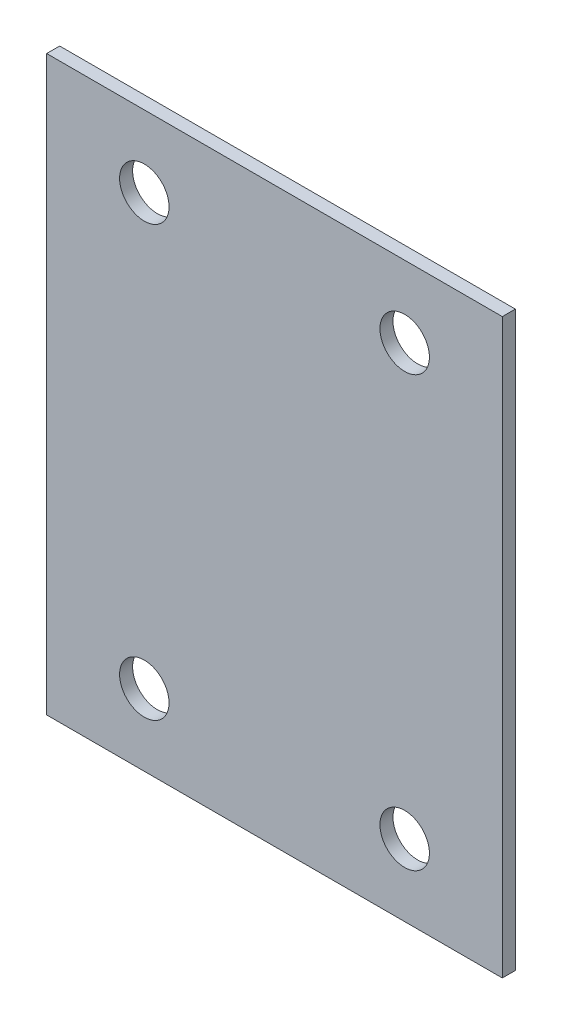
ISO-10303-21;
HEADER;
FILE_DESCRIPTION(('STEP AP214'),'2;1');
FILE_NAME('part.step','',(''),(''),'','','');
FILE_SCHEMA(('AUTOMOTIVE_DESIGN { 1 0 10303 214 1 1 1 1 }'));
ENDSEC;
DATA;
#1=APPLICATION_CONTEXT('core data for automotive mechanical design processes');
#2=APPLICATION_PROTOCOL_DEFINITION('international standard','automotive_design',2000,#1);
#3=PRODUCT_CONTEXT('',#1,'mechanical');
#4=PRODUCT('Part','Part','',(#3));
#5=PRODUCT_RELATED_PRODUCT_CATEGORY('part','',(#4));
#6=PRODUCT_DEFINITION_FORMATION('','',#4);
#7=PRODUCT_DEFINITION_CONTEXT('part definition',#1,'design');
#8=PRODUCT_DEFINITION('design','',#6,#7);
#9=PRODUCT_DEFINITION_SHAPE('','',#8);
#10=(LENGTH_UNIT() NAMED_UNIT(*) SI_UNIT(.MILLI.,.METRE.));
#11=(NAMED_UNIT(*) PLANE_ANGLE_UNIT() SI_UNIT($,.RADIAN.));
#12=(NAMED_UNIT(*) SI_UNIT($,.STERADIAN.) SOLID_ANGLE_UNIT());
#13=UNCERTAINTY_MEASURE_WITH_UNIT(LENGTH_MEASURE(1.E-05),#10,'distance_accuracy_value','');
#14=(GEOMETRIC_REPRESENTATION_CONTEXT(3) GLOBAL_UNCERTAINTY_ASSIGNED_CONTEXT((#13)) GLOBAL_UNIT_ASSIGNED_CONTEXT((#10,
#11,#12)) REPRESENTATION_CONTEXT('',''));
#15=CARTESIAN_POINT('',(0.,0.,0.));
#16=DIRECTION('',(0.,0.,1.));
#17=DIRECTION('',(1.,0.,0.));
#18=AXIS2_PLACEMENT_3D('',#15,#16,#17);
#19=CARTESIAN_POINT('',(0.,0.,10.));
#20=DIRECTION('',(0.,0.,1.));
#21=DIRECTION('',(1.,0.,0.));
#22=AXIS2_PLACEMENT_3D('',#19,#20,#21);
#23=PLANE('',#22);
#24=CARTESIAN_POINT('',(100.,-165.,10.));
#25=DIRECTION('',(0.,0.,1.));
#26=DIRECTION('',(1.,0.,0.));
#27=AXIS2_PLACEMENT_3D('',#24,#25,#26);
#28=CIRCLE('',#27,19.);
#29=CARTESIAN_POINT('',(119.,-165.,10.));
#30=VERTEX_POINT('',#29);
#31=EDGE_CURVE('E121',#30,#30,#28,.T.);
#32=ORIENTED_EDGE('',*,*,#31,.F.);
#33=EDGE_LOOP('',(#32));
#34=FACE_BOUND('',#33,.T.);
#35=CARTESIAN_POINT('',(-100.,165.,10.));
#36=DIRECTION('',(0.,0.,1.));
#37=DIRECTION('',(1.,0.,0.));
#38=AXIS2_PLACEMENT_3D('',#35,#36,#37);
#39=CIRCLE('',#38,19.0000000000034);
#40=CARTESIAN_POINT('',(-80.9999999999966,165.,10.));
#41=VERTEX_POINT('',#40);
#42=EDGE_CURVE('E100',#41,#41,#39,.T.);
#43=ORIENTED_EDGE('',*,*,#42,.F.);
#44=EDGE_LOOP('',(#43));
#45=FACE_BOUND('',#44,.T.);
#46=DIRECTION('',(1.,0.,0.));
#47=VECTOR('',#46,1.);
#48=CARTESIAN_POINT('',(-175.,-220.,10.));
#49=LINE('',#48,#47);
#50=CARTESIAN_POINT('',(-175.,-220.,10.));
#51=VERTEX_POINT('',#50);
#52=CARTESIAN_POINT('',(175.,-220.,10.));
#53=VERTEX_POINT('',#52);
#54=EDGE_CURVE('E85',#51,#53,#49,.T.);
#55=ORIENTED_EDGE('',*,*,#54,.T.);
#56=DIRECTION('',(0.,1.,0.));
#57=VECTOR('',#56,1.);
#58=CARTESIAN_POINT('',(175.,-220.,10.));
#59=LINE('',#58,#57);
#60=CARTESIAN_POINT('',(175.,220.,10.));
#61=VERTEX_POINT('',#60);
#62=EDGE_CURVE('E80',#53,#61,#59,.T.);
#63=ORIENTED_EDGE('',*,*,#62,.T.);
#64=DIRECTION('',(-1.,0.,0.));
#65=VECTOR('',#64,1.);
#66=CARTESIAN_POINT('',(175.,220.,10.));
#67=LINE('',#66,#65);
#68=CARTESIAN_POINT('',(-175.,220.,10.));
#69=VERTEX_POINT('',#68);
#70=EDGE_CURVE('E83',#61,#69,#67,.T.);
#71=ORIENTED_EDGE('',*,*,#70,.T.);
#72=DIRECTION('',(0.,-1.,0.));
#73=VECTOR('',#72,1.);
#74=CARTESIAN_POINT('',(-175.,220.,10.));
#75=LINE('',#74,#73);
#76=EDGE_CURVE('E50',#69,#51,#75,.T.);
#77=ORIENTED_EDGE('',*,*,#76,.T.);
#78=EDGE_LOOP('',(#55,#63,#71,#77));
#79=FACE_BOUND('',#78,.T.);
#80=CARTESIAN_POINT('',(100.,165.,10.));
#81=DIRECTION('',(0.,0.,1.));
#82=DIRECTION('',(1.,0.,0.));
#83=AXIS2_PLACEMENT_3D('',#80,#81,#82);
#84=CIRCLE('',#83,18.999999999996);
#85=CARTESIAN_POINT('',(118.999999999996,165.,10.));
#86=VERTEX_POINT('',#85);
#87=EDGE_CURVE('E115',#86,#86,#84,.T.);
#88=ORIENTED_EDGE('',*,*,#87,.F.);
#89=EDGE_LOOP('',(#88));
#90=FACE_BOUND('',#89,.T.);
#91=CARTESIAN_POINT('',(-100.,-165.,10.));
#92=DIRECTION('',(0.,0.,1.));
#93=DIRECTION('',(1.,0.,0.));
#94=AXIS2_PLACEMENT_3D('',#91,#92,#93);
#95=CIRCLE('',#94,19.);
#96=CARTESIAN_POINT('',(-81.,-165.,10.));
#97=VERTEX_POINT('',#96);
#98=EDGE_CURVE('E127',#97,#97,#95,.T.);
#99=ORIENTED_EDGE('',*,*,#98,.F.);
#100=EDGE_LOOP('',(#99));
#101=FACE_BOUND('',#100,.T.);
#102=ADVANCED_FACE('F33',(#34,#45,#79,#90,#101),#23,.T.);
#103=CARTESIAN_POINT('',(0.,0.,0.));
#104=DIRECTION('',(0.,0.,1.));
#105=DIRECTION('',(1.,0.,0.));
#106=AXIS2_PLACEMENT_3D('',#103,#104,#105);
#107=PLANE('',#106);
#108=DIRECTION('',(1.,0.,0.));
#109=VECTOR('',#108,1.);
#110=CARTESIAN_POINT('',(-175.,-220.,0.));
#111=LINE('',#110,#109);
#112=CARTESIAN_POINT('',(-175.,-220.,0.));
#113=VERTEX_POINT('',#112);
#114=CARTESIAN_POINT('',(175.,-220.,0.));
#115=VERTEX_POINT('',#114);
#116=EDGE_CURVE('E97',#113,#115,#111,.T.);
#117=ORIENTED_EDGE('',*,*,#116,.F.);
#118=DIRECTION('',(0.,-1.,0.));
#119=VECTOR('',#118,1.);
#120=CARTESIAN_POINT('',(-175.,220.,0.));
#121=LINE('',#120,#119);
#122=CARTESIAN_POINT('',(-175.,220.,0.));
#123=VERTEX_POINT('',#122);
#124=EDGE_CURVE('E73',#123,#113,#121,.T.);
#125=ORIENTED_EDGE('',*,*,#124,.F.);
#126=DIRECTION('',(-1.,0.,0.));
#127=VECTOR('',#126,1.);
#128=CARTESIAN_POINT('',(175.,220.,0.));
#129=LINE('',#128,#127);
#130=CARTESIAN_POINT('',(175.,220.,0.));
#131=VERTEX_POINT('',#130);
#132=EDGE_CURVE('E67',#131,#123,#129,.T.);
#133=ORIENTED_EDGE('',*,*,#132,.F.);
#134=DIRECTION('',(0.,1.,0.));
#135=VECTOR('',#134,1.);
#136=CARTESIAN_POINT('',(175.,-220.,0.));
#137=LINE('',#136,#135);
#138=EDGE_CURVE('E89',#115,#131,#137,.T.);
#139=ORIENTED_EDGE('',*,*,#138,.F.);
#140=EDGE_LOOP('',(#117,#125,#133,#139));
#141=FACE_BOUND('',#140,.T.);
#142=CARTESIAN_POINT('',(-100.,165.,0.));
#143=DIRECTION('',(0.,0.,1.));
#144=DIRECTION('',(1.,0.,0.));
#145=AXIS2_PLACEMENT_3D('',#142,#143,#144);
#146=CIRCLE('',#145,19.0000000000034);
#147=CARTESIAN_POINT('',(-80.9999999999966,165.,0.));
#148=VERTEX_POINT('',#147);
#149=EDGE_CURVE('E112',#148,#148,#146,.T.);
#150=ORIENTED_EDGE('',*,*,#149,.T.);
#151=EDGE_LOOP('',(#150));
#152=FACE_BOUND('',#151,.T.);
#153=CARTESIAN_POINT('',(100.,165.,0.));
#154=DIRECTION('',(0.,0.,1.));
#155=DIRECTION('',(1.,0.,0.));
#156=AXIS2_PLACEMENT_3D('',#153,#154,#155);
#157=CIRCLE('',#156,18.999999999996);
#158=CARTESIAN_POINT('',(118.999999999996,165.,0.));
#159=VERTEX_POINT('',#158);
#160=EDGE_CURVE('E118',#159,#159,#157,.T.);
#161=ORIENTED_EDGE('',*,*,#160,.T.);
#162=EDGE_LOOP('',(#161));
#163=FACE_BOUND('',#162,.T.);
#164=CARTESIAN_POINT('',(100.,-165.,0.));
#165=DIRECTION('',(0.,0.,1.));
#166=DIRECTION('',(1.,0.,0.));
#167=AXIS2_PLACEMENT_3D('',#164,#165,#166);
#168=CIRCLE('',#167,19.);
#169=CARTESIAN_POINT('',(119.,-165.,0.));
#170=VERTEX_POINT('',#169);
#171=EDGE_CURVE('E124',#170,#170,#168,.T.);
#172=ORIENTED_EDGE('',*,*,#171,.T.);
#173=EDGE_LOOP('',(#172));
#174=FACE_BOUND('',#173,.T.);
#175=CARTESIAN_POINT('',(-100.,-165.,0.));
#176=DIRECTION('',(0.,0.,1.));
#177=DIRECTION('',(1.,0.,0.));
#178=AXIS2_PLACEMENT_3D('',#175,#176,#177);
#179=CIRCLE('',#178,19.);
#180=CARTESIAN_POINT('',(-81.,-165.,0.));
#181=VERTEX_POINT('',#180);
#182=EDGE_CURVE('E130',#181,#181,#179,.T.);
#183=ORIENTED_EDGE('',*,*,#182,.T.);
#184=EDGE_LOOP('',(#183));
#185=FACE_BOUND('',#184,.T.);
#186=ADVANCED_FACE('F108',(#141,#152,#163,#174,#185),#107,.F.);
#187=CARTESIAN_POINT('',(-175.,-220.,10.));
#188=DIRECTION('',(0.,1.,0.));
#189=DIRECTION('',(0.,0.,1.));
#190=AXIS2_PLACEMENT_3D('',#187,#188,#189);
#191=PLANE('',#190);
#192=ORIENTED_EDGE('',*,*,#116,.T.);
#193=DIRECTION('',(0.,0.,-1.));
#194=VECTOR('',#193,1.);
#195=CARTESIAN_POINT('',(175.,-220.,10.));
#196=LINE('',#195,#194);
#197=EDGE_CURVE('E11',#53,#115,#196,.T.);
#198=ORIENTED_EDGE('',*,*,#197,.F.);
#199=ORIENTED_EDGE('',*,*,#54,.F.);
#200=DIRECTION('',(0.,0.,-1.));
#201=VECTOR('',#200,1.);
#202=CARTESIAN_POINT('',(-175.,-220.,10.));
#203=LINE('',#202,#201);
#204=EDGE_CURVE('E93',#51,#113,#203,.T.);
#205=ORIENTED_EDGE('',*,*,#204,.T.);
#206=EDGE_LOOP('',(#192,#198,#199,#205));
#207=FACE_BOUND('',#206,.T.);
#208=ADVANCED_FACE('F35',(#207),#191,.F.);
#209=CARTESIAN_POINT('',(175.,-220.,10.));
#210=DIRECTION('',(-1.,0.,0.));
#211=DIRECTION('',(0.,0.,1.));
#212=AXIS2_PLACEMENT_3D('',#209,#210,#211);
#213=PLANE('',#212);
#214=ORIENTED_EDGE('',*,*,#138,.T.);
#215=DIRECTION('',(0.,0.,-1.));
#216=VECTOR('',#215,1.);
#217=CARTESIAN_POINT('',(175.,220.,10.));
#218=LINE('',#217,#216);
#219=EDGE_CURVE('E42',#61,#131,#218,.T.);
#220=ORIENTED_EDGE('',*,*,#219,.F.);
#221=ORIENTED_EDGE('',*,*,#62,.F.);
#222=ORIENTED_EDGE('',*,*,#197,.T.);
#223=EDGE_LOOP('',(#214,#220,#221,#222));
#224=FACE_BOUND('',#223,.T.);
#225=ADVANCED_FACE('F88',(#224),#213,.F.);
#226=CARTESIAN_POINT('',(175.,220.,10.));
#227=DIRECTION('',(0.,-1.,0.));
#228=DIRECTION('',(0.,0.,-1.));
#229=AXIS2_PLACEMENT_3D('',#226,#227,#228);
#230=PLANE('',#229);
#231=ORIENTED_EDGE('',*,*,#132,.T.);
#232=DIRECTION('',(0.,0.,-1.));
#233=VECTOR('',#232,1.);
#234=CARTESIAN_POINT('',(-175.,220.,10.));
#235=LINE('',#234,#233);
#236=EDGE_CURVE('E90',#69,#123,#235,.T.);
#237=ORIENTED_EDGE('',*,*,#236,.F.);
#238=ORIENTED_EDGE('',*,*,#70,.F.);
#239=ORIENTED_EDGE('',*,*,#219,.T.);
#240=EDGE_LOOP('',(#231,#237,#238,#239));
#241=FACE_BOUND('',#240,.T.);
#242=ADVANCED_FACE('F91',(#241),#230,.F.);
#243=CARTESIAN_POINT('',(-175.,220.,10.));
#244=DIRECTION('',(1.,0.,0.));
#245=DIRECTION('',(0.,0.,-1.));
#246=AXIS2_PLACEMENT_3D('',#243,#244,#245);
#247=PLANE('',#246);
#248=ORIENTED_EDGE('',*,*,#124,.T.);
#249=ORIENTED_EDGE('',*,*,#204,.F.);
#250=ORIENTED_EDGE('',*,*,#76,.F.);
#251=ORIENTED_EDGE('',*,*,#236,.T.);
#252=EDGE_LOOP('',(#248,#249,#250,#251));
#253=FACE_BOUND('',#252,.T.);
#254=ADVANCED_FACE('F105',(#253),#247,.F.);
#255=CARTESIAN_POINT('',(-100.,165.,10.));
#256=DIRECTION('',(0.,0.,-1.));
#257=DIRECTION('',(-1.,0.,0.));
#258=AXIS2_PLACEMENT_3D('',#255,#256,#257);
#259=CYLINDRICAL_SURFACE('',#258,19.0000000000034);
#260=ORIENTED_EDGE('',*,*,#42,.T.);
#261=EDGE_LOOP('',(#260));
#262=FACE_BOUND('',#261,.T.);
#263=ORIENTED_EDGE('',*,*,#149,.F.);
#264=EDGE_LOOP('',(#263));
#265=FACE_BOUND('',#264,.T.);
#266=ADVANCED_FACE('F149',(#262,#265),#259,.F.);
#267=CARTESIAN_POINT('',(100.,165.,10.));
#268=DIRECTION('',(0.,0.,-1.));
#269=DIRECTION('',(-1.,0.,0.));
#270=AXIS2_PLACEMENT_3D('',#267,#268,#269);
#271=CYLINDRICAL_SURFACE('',#270,18.999999999996);
#272=ORIENTED_EDGE('',*,*,#87,.T.);
#273=EDGE_LOOP('',(#272));
#274=FACE_BOUND('',#273,.T.);
#275=ORIENTED_EDGE('',*,*,#160,.F.);
#276=EDGE_LOOP('',(#275));
#277=FACE_BOUND('',#276,.T.);
#278=ADVANCED_FACE('F195',(#274,#277),#271,.F.);
#279=CARTESIAN_POINT('',(100.,-165.,10.));
#280=DIRECTION('',(0.,0.,-1.));
#281=DIRECTION('',(-1.,0.,0.));
#282=AXIS2_PLACEMENT_3D('',#279,#280,#281);
#283=CYLINDRICAL_SURFACE('',#282,19.);
#284=ORIENTED_EDGE('',*,*,#31,.T.);
#285=EDGE_LOOP('',(#284));
#286=FACE_BOUND('',#285,.T.);
#287=ORIENTED_EDGE('',*,*,#171,.F.);
#288=EDGE_LOOP('',(#287));
#289=FACE_BOUND('',#288,.T.);
#290=ADVANCED_FACE('F203',(#286,#289),#283,.F.);
#291=CARTESIAN_POINT('',(-100.,-165.,10.));
#292=DIRECTION('',(0.,0.,-1.));
#293=DIRECTION('',(-1.,0.,0.));
#294=AXIS2_PLACEMENT_3D('',#291,#292,#293);
#295=CYLINDRICAL_SURFACE('',#294,19.);
#296=ORIENTED_EDGE('',*,*,#98,.T.);
#297=EDGE_LOOP('',(#296));
#298=FACE_BOUND('',#297,.T.);
#299=ORIENTED_EDGE('',*,*,#182,.F.);
#300=EDGE_LOOP('',(#299));
#301=FACE_BOUND('',#300,.T.);
#302=ADVANCED_FACE('F136',(#298,#301),#295,.F.);
#303=CLOSED_SHELL('',(#102,#186,#208,#225,#242,#254,#266,#278,#290,#302));
#304=MANIFOLD_SOLID_BREP('B2',#303);
#305=ADVANCED_BREP_SHAPE_REPRESENTATION('',(#18,#304),#14);
#306=SHAPE_DEFINITION_REPRESENTATION(#9,#305);
ENDSEC;
END-ISO-10303-21;
